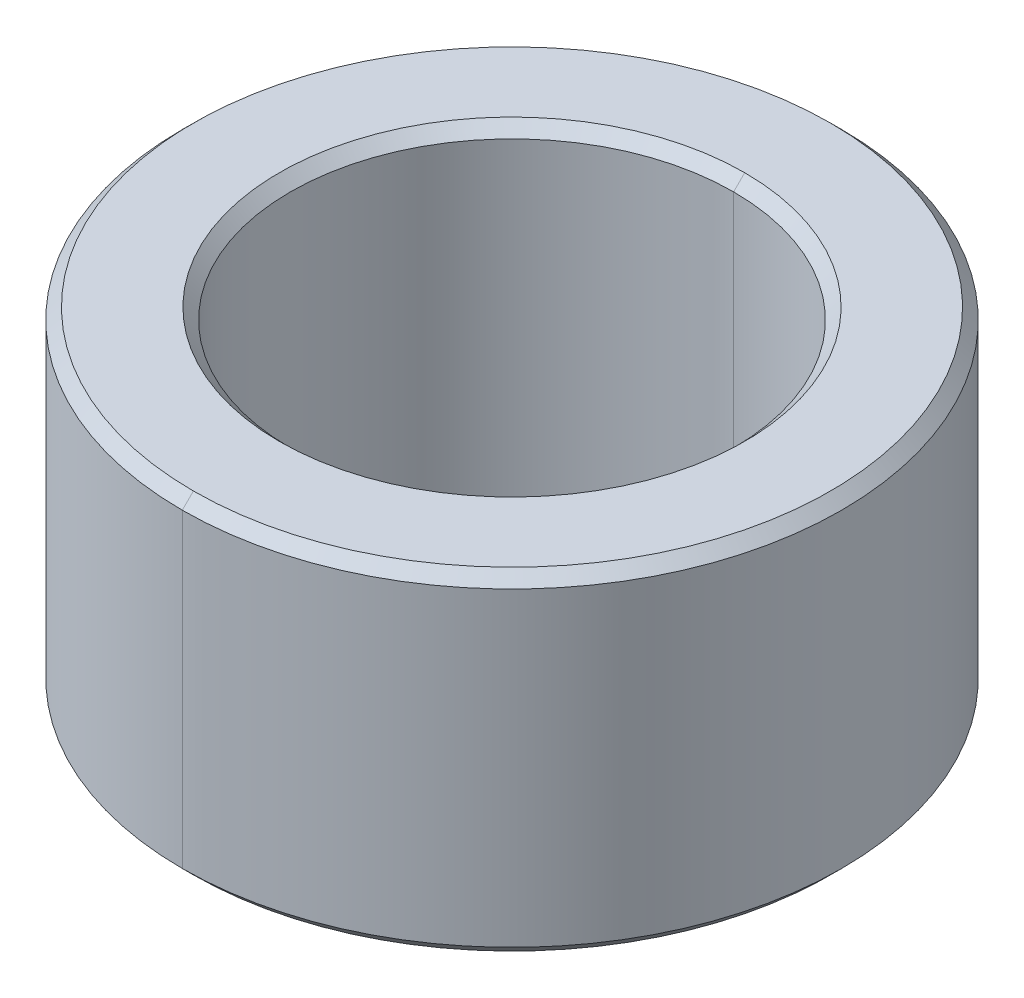
ISO-10303-21;
HEADER;
FILE_DESCRIPTION(('STEP AP214'),'2;1');
FILE_NAME('part.step','',(''),(''),'','','');
FILE_SCHEMA(('AUTOMOTIVE_DESIGN { 1 0 10303 214 1 1 1 1 }'));
ENDSEC;
DATA;
#1=APPLICATION_CONTEXT('core data for automotive mechanical design processes');
#2=APPLICATION_PROTOCOL_DEFINITION('international standard','automotive_design',2000,#1);
#3=PRODUCT_CONTEXT('',#1,'mechanical');
#4=PRODUCT('Part','Part','',(#3));
#5=PRODUCT_RELATED_PRODUCT_CATEGORY('part','',(#4));
#6=PRODUCT_DEFINITION_FORMATION('','',#4);
#7=PRODUCT_DEFINITION_CONTEXT('part definition',#1,'design');
#8=PRODUCT_DEFINITION('design','',#6,#7);
#9=PRODUCT_DEFINITION_SHAPE('','',#8);
#10=(LENGTH_UNIT() NAMED_UNIT(*) SI_UNIT(.MILLI.,.METRE.));
#11=(NAMED_UNIT(*) PLANE_ANGLE_UNIT() SI_UNIT($,.RADIAN.));
#12=(NAMED_UNIT(*) SI_UNIT($,.STERADIAN.) SOLID_ANGLE_UNIT());
#13=UNCERTAINTY_MEASURE_WITH_UNIT(LENGTH_MEASURE(1.E-05),#10,'distance_accuracy_value','');
#14=(GEOMETRIC_REPRESENTATION_CONTEXT(3) GLOBAL_UNCERTAINTY_ASSIGNED_CONTEXT((#13)) GLOBAL_UNIT_ASSIGNED_CONTEXT((#10,
#11,#12)) REPRESENTATION_CONTEXT('',''));
#15=CARTESIAN_POINT('',(0.,0.,0.));
#16=DIRECTION('',(0.,0.,1.));
#17=DIRECTION('',(1.,0.,0.));
#18=AXIS2_PLACEMENT_3D('',#15,#16,#17);
#19=CARTESIAN_POINT('',(0.,1.4,0.));
#20=DIRECTION('',(0.,1.,0.));
#21=DIRECTION('',(0.,0.,1.));
#22=AXIS2_PLACEMENT_3D('',#19,#20,#21);
#23=CONICAL_SURFACE('',#22,2.,0.78539816339745);
#24=DIRECTION('',(0.,0.707106781186546,-0.707106781186549));
#25=VECTOR('',#24,1.);
#26=CARTESIAN_POINT('',(0.,1.4,-2.));
#27=LINE('',#26,#25);
#28=CARTESIAN_POINT('',(0.,1.4,-2.));
#29=VERTEX_POINT('',#28);
#30=CARTESIAN_POINT('',(0.,1.5,-2.1));
#31=VERTEX_POINT('',#30);
#32=EDGE_CURVE('E175',#29,#31,#27,.T.);
#33=ORIENTED_EDGE('',*,*,#32,.F.);
#34=CARTESIAN_POINT('',(0.,1.4,0.));
#35=DIRECTION('',(0.,1.,0.));
#36=DIRECTION('',(0.,0.,1.));
#37=AXIS2_PLACEMENT_3D('',#34,#35,#36);
#38=CIRCLE('',#37,2.);
#39=CARTESIAN_POINT('',(0.,1.4,2.));
#40=VERTEX_POINT('',#39);
#41=EDGE_CURVE('E24',#40,#29,#38,.T.);
#42=ORIENTED_EDGE('',*,*,#41,.F.);
#43=DIRECTION('',(0.,0.707106781186546,0.707106781186549));
#44=VECTOR('',#43,1.);
#45=CARTESIAN_POINT('',(0.,1.4,2.));
#46=LINE('',#45,#44);
#47=CARTESIAN_POINT('',(0.,1.5,2.1));
#48=VERTEX_POINT('',#47);
#49=EDGE_CURVE('E134',#40,#48,#46,.T.);
#50=ORIENTED_EDGE('',*,*,#49,.T.);
#51=CARTESIAN_POINT('',(0.,1.5,0.));
#52=DIRECTION('',(0.,-1.,0.));
#53=DIRECTION('',(0.,0.,1.));
#54=AXIS2_PLACEMENT_3D('',#51,#52,#53);
#55=CIRCLE('',#54,2.1);
#56=EDGE_CURVE('E57',#31,#48,#55,.T.);
#57=ORIENTED_EDGE('',*,*,#56,.F.);
#58=EDGE_LOOP('',(#33,#42,#50,#57));
#59=FACE_BOUND('',#58,.T.);
#60=ADVANCED_FACE('F14',(#59),#23,.F.);
#61=CARTESIAN_POINT('',(0.,-1.5,0.));
#62=DIRECTION('',(0.,-1.,0.));
#63=DIRECTION('',(0.,0.,-1.));
#64=AXIS2_PLACEMENT_3D('',#61,#62,#63);
#65=CONICAL_SURFACE('',#64,2.1,0.78539816339744);
#66=DIRECTION('',(0.,-0.707106781186554,0.707106781186542));
#67=VECTOR('',#66,1.);
#68=CARTESIAN_POINT('',(0.,-1.5,2.1));
#69=LINE('',#68,#67);
#70=CARTESIAN_POINT('',(0.,-1.4,2.));
#71=VERTEX_POINT('',#70);
#72=CARTESIAN_POINT('',(0.,-1.5,2.1));
#73=VERTEX_POINT('',#72);
#74=EDGE_CURVE('E111',#71,#73,#69,.T.);
#75=ORIENTED_EDGE('',*,*,#74,.F.);
#76=CARTESIAN_POINT('',(0.,-1.4,0.));
#77=DIRECTION('',(0.,-1.,0.));
#78=DIRECTION('',(0.,0.,1.));
#79=AXIS2_PLACEMENT_3D('',#76,#77,#78);
#80=CIRCLE('',#79,2.);
#81=CARTESIAN_POINT('',(0.,-1.4,-2.));
#82=VERTEX_POINT('',#81);
#83=EDGE_CURVE('E9',#82,#71,#80,.T.);
#84=ORIENTED_EDGE('',*,*,#83,.F.);
#85=DIRECTION('',(0.,-0.707106781186554,-0.707106781186542));
#86=VECTOR('',#85,1.);
#87=CARTESIAN_POINT('',(0.,-1.5,-2.1));
#88=LINE('',#87,#86);
#89=CARTESIAN_POINT('',(0.,-1.5,-2.1));
#90=VERTEX_POINT('',#89);
#91=EDGE_CURVE('E108',#82,#90,#88,.T.);
#92=ORIENTED_EDGE('',*,*,#91,.T.);
#93=CARTESIAN_POINT('',(0.,-1.5,0.));
#94=DIRECTION('',(0.,1.,0.));
#95=DIRECTION('',(0.,0.,1.));
#96=AXIS2_PLACEMENT_3D('',#93,#94,#95);
#97=CIRCLE('',#96,2.1);
#98=EDGE_CURVE('E149',#73,#90,#97,.T.);
#99=ORIENTED_EDGE('',*,*,#98,.F.);
#100=EDGE_LOOP('',(#75,#84,#92,#99));
#101=FACE_BOUND('',#100,.T.);
#102=ADVANCED_FACE('F106',(#101),#65,.F.);
#103=CARTESIAN_POINT('',(0.,1.5,0.));
#104=DIRECTION('',(0.,-1.,0.));
#105=DIRECTION('',(0.,0.,-1.));
#106=AXIS2_PLACEMENT_3D('',#103,#104,#105);
#107=CONICAL_SURFACE('',#106,2.875,0.785398163397448);
#108=DIRECTION('',(0.,-0.707106781186548,0.707106781186548));
#109=VECTOR('',#108,1.);
#110=CARTESIAN_POINT('',(0.,1.5,2.875));
#111=LINE('',#110,#109);
#112=CARTESIAN_POINT('',(0.,1.5,2.875));
#113=VERTEX_POINT('',#112);
#114=CARTESIAN_POINT('',(0.,1.4,2.975));
#115=VERTEX_POINT('',#114);
#116=EDGE_CURVE('E262',#113,#115,#111,.T.);
#117=ORIENTED_EDGE('',*,*,#116,.F.);
#118=CARTESIAN_POINT('',(0.,1.5,0.));
#119=DIRECTION('',(0.,1.,0.));
#120=DIRECTION('',(0.,0.,1.));
#121=AXIS2_PLACEMENT_3D('',#118,#119,#120);
#122=CIRCLE('',#121,2.875);
#123=CARTESIAN_POINT('',(0.,1.5,-2.875));
#124=VERTEX_POINT('',#123);
#125=EDGE_CURVE('E181',#124,#113,#122,.T.);
#126=ORIENTED_EDGE('',*,*,#125,.F.);
#127=DIRECTION('',(0.,-0.707106781186548,-0.707106781186548));
#128=VECTOR('',#127,1.);
#129=CARTESIAN_POINT('',(0.,1.5,-2.875));
#130=LINE('',#129,#128);
#131=CARTESIAN_POINT('',(0.,1.4,-2.975));
#132=VERTEX_POINT('',#131);
#133=EDGE_CURVE('E165',#124,#132,#130,.T.);
#134=ORIENTED_EDGE('',*,*,#133,.T.);
#135=CARTESIAN_POINT('',(0.,1.4,0.));
#136=DIRECTION('',(0.,-1.,0.));
#137=DIRECTION('',(0.,0.,1.));
#138=AXIS2_PLACEMENT_3D('',#135,#136,#137);
#139=CIRCLE('',#138,2.975);
#140=EDGE_CURVE('E160',#115,#132,#139,.T.);
#141=ORIENTED_EDGE('',*,*,#140,.F.);
#142=EDGE_LOOP('',(#117,#126,#134,#141));
#143=FACE_BOUND('',#142,.T.);
#144=ADVANCED_FACE('F211',(#143),#107,.T.);
#145=CARTESIAN_POINT('',(0.,-1.4,0.));
#146=DIRECTION('',(0.,1.,0.));
#147=DIRECTION('',(0.,0.,1.));
#148=AXIS2_PLACEMENT_3D('',#145,#146,#147);
#149=CONICAL_SURFACE('',#148,2.975,0.785398163397448);
#150=DIRECTION('',(0.,0.707106781186548,-0.707106781186548));
#151=VECTOR('',#150,1.);
#152=CARTESIAN_POINT('',(0.,-1.4,-2.975));
#153=LINE('',#152,#151);
#154=CARTESIAN_POINT('',(0.,-1.5,-2.875));
#155=VERTEX_POINT('',#154);
#156=CARTESIAN_POINT('',(0.,-1.4,-2.975));
#157=VERTEX_POINT('',#156);
#158=EDGE_CURVE('E164',#155,#157,#153,.T.);
#159=ORIENTED_EDGE('',*,*,#158,.F.);
#160=CARTESIAN_POINT('',(0.,-1.5,0.));
#161=DIRECTION('',(0.,-1.,0.));
#162=DIRECTION('',(0.,0.,1.));
#163=AXIS2_PLACEMENT_3D('',#160,#161,#162);
#164=CIRCLE('',#163,2.875);
#165=CARTESIAN_POINT('',(0.,-1.5,2.875));
#166=VERTEX_POINT('',#165);
#167=EDGE_CURVE('E148',#166,#155,#164,.T.);
#168=ORIENTED_EDGE('',*,*,#167,.F.);
#169=DIRECTION('',(0.,0.707106781186548,0.707106781186548));
#170=VECTOR('',#169,1.);
#171=CARTESIAN_POINT('',(0.,-1.4,2.975));
#172=LINE('',#171,#170);
#173=CARTESIAN_POINT('',(0.,-1.4,2.975));
#174=VERTEX_POINT('',#173);
#175=EDGE_CURVE('E151',#166,#174,#172,.T.);
#176=ORIENTED_EDGE('',*,*,#175,.T.);
#177=CARTESIAN_POINT('',(0.,-1.4,0.));
#178=DIRECTION('',(0.,1.,0.));
#179=DIRECTION('',(0.,0.,1.));
#180=AXIS2_PLACEMENT_3D('',#177,#178,#179);
#181=CIRCLE('',#180,2.975);
#182=EDGE_CURVE('E38',#157,#174,#181,.T.);
#183=ORIENTED_EDGE('',*,*,#182,.F.);
#184=EDGE_LOOP('',(#159,#168,#176,#183));
#185=FACE_BOUND('',#184,.T.);
#186=ADVANCED_FACE('F216',(#185),#149,.T.);
#187=CARTESIAN_POINT('',(0.,1.5,0.));
#188=DIRECTION('',(0.,-1.,0.));
#189=DIRECTION('',(0.,0.,-1.));
#190=AXIS2_PLACEMENT_3D('',#187,#188,#189);
#191=CYLINDRICAL_SURFACE('',#190,2.);
#192=DIRECTION('',(0.,-1.,0.));
#193=VECTOR('',#192,1.);
#194=CARTESIAN_POINT('',(0.,1.5,2.));
#195=LINE('',#194,#193);
#196=EDGE_CURVE('E17',#40,#71,#195,.T.);
#197=ORIENTED_EDGE('',*,*,#196,.F.);
#198=ORIENTED_EDGE('',*,*,#41,.T.);
#199=DIRECTION('',(0.,-1.,0.));
#200=VECTOR('',#199,1.);
#201=CARTESIAN_POINT('',(0.,1.5,-2.));
#202=LINE('',#201,#200);
#203=EDGE_CURVE('E116',#29,#82,#202,.T.);
#204=ORIENTED_EDGE('',*,*,#203,.T.);
#205=ORIENTED_EDGE('',*,*,#83,.T.);
#206=EDGE_LOOP('',(#197,#198,#204,#205));
#207=FACE_BOUND('',#206,.T.);
#208=ADVANCED_FACE('F117',(#207),#191,.F.);
#209=CARTESIAN_POINT('',(0.,1.5,0.));
#210=DIRECTION('',(0.,-1.,0.));
#211=DIRECTION('',(0.,0.,-1.));
#212=AXIS2_PLACEMENT_3D('',#209,#210,#211);
#213=CYLINDRICAL_SURFACE('',#212,2.975);
#214=DIRECTION('',(0.,-1.,0.));
#215=VECTOR('',#214,1.);
#216=CARTESIAN_POINT('',(0.,1.5,2.975));
#217=LINE('',#216,#215);
#218=EDGE_CURVE('E122',#115,#174,#217,.T.);
#219=ORIENTED_EDGE('',*,*,#218,.F.);
#220=ORIENTED_EDGE('',*,*,#140,.T.);
#221=DIRECTION('',(0.,-1.,0.));
#222=VECTOR('',#221,1.);
#223=CARTESIAN_POINT('',(0.,1.5,-2.975));
#224=LINE('',#223,#222);
#225=EDGE_CURVE('E169',#132,#157,#224,.T.);
#226=ORIENTED_EDGE('',*,*,#225,.T.);
#227=ORIENTED_EDGE('',*,*,#182,.T.);
#228=EDGE_LOOP('',(#219,#220,#226,#227));
#229=FACE_BOUND('',#228,.T.);
#230=ADVANCED_FACE('F230',(#229),#213,.T.);
#231=CARTESIAN_POINT('',(0.,-1.5,0.));
#232=DIRECTION('',(0.,1.,0.));
#233=DIRECTION('',(1.,0.,0.));
#234=AXIS2_PLACEMENT_3D('',#231,#232,#233);
#235=PLANE('',#234);
#236=CARTESIAN_POINT('',(0.,-1.5,0.));
#237=DIRECTION('',(0.,1.,0.));
#238=DIRECTION('',(0.,0.,1.));
#239=AXIS2_PLACEMENT_3D('',#236,#237,#238);
#240=CIRCLE('',#239,2.1);
#241=EDGE_CURVE('E128',#90,#73,#240,.T.);
#242=ORIENTED_EDGE('',*,*,#241,.T.);
#243=ORIENTED_EDGE('',*,*,#98,.T.);
#244=EDGE_LOOP('',(#242,#243));
#245=FACE_BOUND('',#244,.T.);
#246=ORIENTED_EDGE('',*,*,#167,.T.);
#247=CARTESIAN_POINT('',(0.,-1.5,0.));
#248=DIRECTION('',(0.,-1.,0.));
#249=DIRECTION('',(0.,0.,1.));
#250=AXIS2_PLACEMENT_3D('',#247,#248,#249);
#251=CIRCLE('',#250,2.875);
#252=EDGE_CURVE('E161',#155,#166,#251,.T.);
#253=ORIENTED_EDGE('',*,*,#252,.T.);
#254=EDGE_LOOP('',(#246,#253));
#255=FACE_BOUND('',#254,.T.);
#256=ADVANCED_FACE('F233',(#245,#255),#235,.F.);
#257=CARTESIAN_POINT('',(0.,1.5,0.));
#258=DIRECTION('',(0.,1.,0.));
#259=DIRECTION('',(1.,0.,0.));
#260=AXIS2_PLACEMENT_3D('',#257,#258,#259);
#261=PLANE('',#260);
#262=CARTESIAN_POINT('',(0.,1.5,0.));
#263=DIRECTION('',(0.,-1.,0.));
#264=DIRECTION('',(0.,0.,1.));
#265=AXIS2_PLACEMENT_3D('',#262,#263,#264);
#266=CIRCLE('',#265,2.1);
#267=EDGE_CURVE('E143',#48,#31,#266,.T.);
#268=ORIENTED_EDGE('',*,*,#267,.T.);
#269=ORIENTED_EDGE('',*,*,#56,.T.);
#270=EDGE_LOOP('',(#268,#269));
#271=FACE_BOUND('',#270,.T.);
#272=ORIENTED_EDGE('',*,*,#125,.T.);
#273=CARTESIAN_POINT('',(0.,1.5,0.));
#274=DIRECTION('',(0.,1.,0.));
#275=DIRECTION('',(0.,0.,1.));
#276=AXIS2_PLACEMENT_3D('',#273,#274,#275);
#277=CIRCLE('',#276,2.875);
#278=EDGE_CURVE('E130',#113,#124,#277,.T.);
#279=ORIENTED_EDGE('',*,*,#278,.T.);
#280=EDGE_LOOP('',(#272,#279));
#281=FACE_BOUND('',#280,.T.);
#282=ADVANCED_FACE('F202',(#271,#281),#261,.T.);
#283=CARTESIAN_POINT('',(0.,1.5,0.));
#284=DIRECTION('',(0.,-1.,0.));
#285=DIRECTION('',(0.,0.,-1.));
#286=AXIS2_PLACEMENT_3D('',#283,#284,#285);
#287=CYLINDRICAL_SURFACE('',#286,2.975);
#288=CARTESIAN_POINT('',(0.,1.4,0.));
#289=DIRECTION('',(0.,-1.,0.));
#290=DIRECTION('',(0.,0.,1.));
#291=AXIS2_PLACEMENT_3D('',#288,#289,#290);
#292=CIRCLE('',#291,2.975);
#293=EDGE_CURVE('E188',#132,#115,#292,.T.);
#294=ORIENTED_EDGE('',*,*,#293,.T.);
#295=ORIENTED_EDGE('',*,*,#218,.T.);
#296=CARTESIAN_POINT('',(0.,-1.4,0.));
#297=DIRECTION('',(0.,1.,0.));
#298=DIRECTION('',(0.,0.,1.));
#299=AXIS2_PLACEMENT_3D('',#296,#297,#298);
#300=CIRCLE('',#299,2.975);
#301=EDGE_CURVE('E155',#174,#157,#300,.T.);
#302=ORIENTED_EDGE('',*,*,#301,.T.);
#303=ORIENTED_EDGE('',*,*,#225,.F.);
#304=EDGE_LOOP('',(#294,#295,#302,#303));
#305=FACE_BOUND('',#304,.T.);
#306=ADVANCED_FACE('F226',(#305),#287,.T.);
#307=CARTESIAN_POINT('',(0.,1.5,0.));
#308=DIRECTION('',(0.,-1.,0.));
#309=DIRECTION('',(0.,0.,-1.));
#310=AXIS2_PLACEMENT_3D('',#307,#308,#309);
#311=CYLINDRICAL_SURFACE('',#310,2.);
#312=CARTESIAN_POINT('',(0.,1.4,0.));
#313=DIRECTION('',(0.,1.,0.));
#314=DIRECTION('',(0.,0.,1.));
#315=AXIS2_PLACEMENT_3D('',#312,#313,#314);
#316=CIRCLE('',#315,2.);
#317=EDGE_CURVE('E172',#29,#40,#316,.T.);
#318=ORIENTED_EDGE('',*,*,#317,.T.);
#319=ORIENTED_EDGE('',*,*,#196,.T.);
#320=CARTESIAN_POINT('',(0.,-1.4,0.));
#321=DIRECTION('',(0.,-1.,0.));
#322=DIRECTION('',(0.,0.,1.));
#323=AXIS2_PLACEMENT_3D('',#320,#321,#322);
#324=CIRCLE('',#323,2.);
#325=EDGE_CURVE('E126',#71,#82,#324,.T.);
#326=ORIENTED_EDGE('',*,*,#325,.T.);
#327=ORIENTED_EDGE('',*,*,#203,.F.);
#328=EDGE_LOOP('',(#318,#319,#326,#327));
#329=FACE_BOUND('',#328,.T.);
#330=ADVANCED_FACE('F132',(#329),#311,.F.);
#331=CARTESIAN_POINT('',(0.,-1.4,0.));
#332=DIRECTION('',(0.,1.,0.));
#333=DIRECTION('',(0.,0.,1.));
#334=AXIS2_PLACEMENT_3D('',#331,#332,#333);
#335=CONICAL_SURFACE('',#334,2.975,0.785398163397448);
#336=ORIENTED_EDGE('',*,*,#252,.F.);
#337=ORIENTED_EDGE('',*,*,#158,.T.);
#338=ORIENTED_EDGE('',*,*,#301,.F.);
#339=ORIENTED_EDGE('',*,*,#175,.F.);
#340=EDGE_LOOP('',(#336,#337,#338,#339));
#341=FACE_BOUND('',#340,.T.);
#342=ADVANCED_FACE('F224',(#341),#335,.T.);
#343=CARTESIAN_POINT('',(0.,1.5,0.));
#344=DIRECTION('',(0.,-1.,0.));
#345=DIRECTION('',(0.,0.,-1.));
#346=AXIS2_PLACEMENT_3D('',#343,#344,#345);
#347=CONICAL_SURFACE('',#346,2.875,0.785398163397448);
#348=ORIENTED_EDGE('',*,*,#278,.F.);
#349=ORIENTED_EDGE('',*,*,#116,.T.);
#350=ORIENTED_EDGE('',*,*,#293,.F.);
#351=ORIENTED_EDGE('',*,*,#133,.F.);
#352=EDGE_LOOP('',(#348,#349,#350,#351));
#353=FACE_BOUND('',#352,.T.);
#354=ADVANCED_FACE('F221',(#353),#347,.T.);
#355=CARTESIAN_POINT('',(0.,-1.5,0.));
#356=DIRECTION('',(0.,-1.,0.));
#357=DIRECTION('',(0.,0.,-1.));
#358=AXIS2_PLACEMENT_3D('',#355,#356,#357);
#359=CONICAL_SURFACE('',#358,2.1,0.78539816339744);
#360=ORIENTED_EDGE('',*,*,#325,.F.);
#361=ORIENTED_EDGE('',*,*,#74,.T.);
#362=ORIENTED_EDGE('',*,*,#241,.F.);
#363=ORIENTED_EDGE('',*,*,#91,.F.);
#364=EDGE_LOOP('',(#360,#361,#362,#363));
#365=FACE_BOUND('',#364,.T.);
#366=ADVANCED_FACE('F125',(#365),#359,.F.);
#367=CARTESIAN_POINT('',(0.,1.4,0.));
#368=DIRECTION('',(0.,1.,0.));
#369=DIRECTION('',(0.,0.,1.));
#370=AXIS2_PLACEMENT_3D('',#367,#368,#369);
#371=CONICAL_SURFACE('',#370,2.,0.78539816339745);
#372=ORIENTED_EDGE('',*,*,#317,.F.);
#373=ORIENTED_EDGE('',*,*,#32,.T.);
#374=ORIENTED_EDGE('',*,*,#267,.F.);
#375=ORIENTED_EDGE('',*,*,#49,.F.);
#376=EDGE_LOOP('',(#372,#373,#374,#375));
#377=FACE_BOUND('',#376,.T.);
#378=ADVANCED_FACE('F205',(#377),#371,.F.);
#379=CLOSED_SHELL('',(#60,#102,#144,#186,#208,#230,#256,#282,#306,#330,#342,#354,#366,#378));
#380=MANIFOLD_SOLID_BREP('B1',#379);
#381=ADVANCED_BREP_SHAPE_REPRESENTATION('',(#18,#380),#14);
#382=SHAPE_DEFINITION_REPRESENTATION(#9,#381);
ENDSEC;
END-ISO-10303-21;
